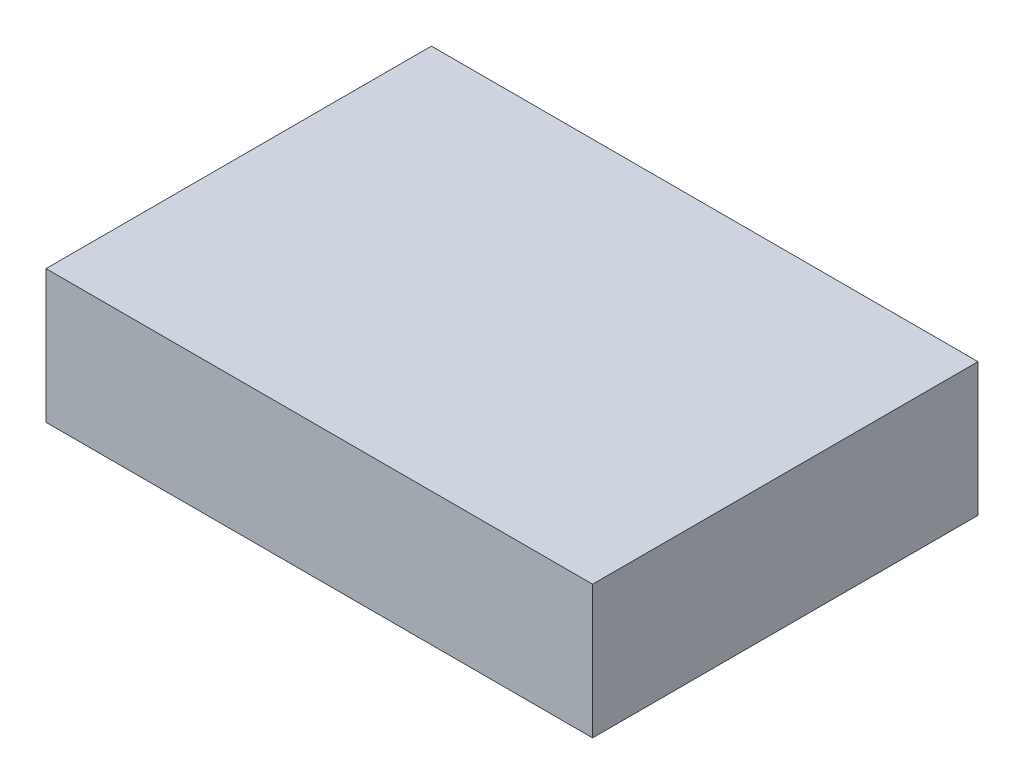
ISO-10303-21;
HEADER;
FILE_DESCRIPTION(('STEP AP214'),'2;1');
FILE_NAME('part.step','',(''),(''),'','','');
FILE_SCHEMA(('AUTOMOTIVE_DESIGN { 1 0 10303 214 1 1 1 1 }'));
ENDSEC;
DATA;
#1=APPLICATION_CONTEXT('core data for automotive mechanical design processes');
#2=APPLICATION_PROTOCOL_DEFINITION('international standard','automotive_design',2000,#1);
#3=PRODUCT_CONTEXT('',#1,'mechanical');
#4=PRODUCT('Part','Part','',(#3));
#5=PRODUCT_RELATED_PRODUCT_CATEGORY('part','',(#4));
#6=PRODUCT_DEFINITION_FORMATION('','',#4);
#7=PRODUCT_DEFINITION_CONTEXT('part definition',#1,'design');
#8=PRODUCT_DEFINITION('design','',#6,#7);
#9=PRODUCT_DEFINITION_SHAPE('','',#8);
#10=(LENGTH_UNIT() NAMED_UNIT(*) SI_UNIT(.MILLI.,.METRE.));
#11=(NAMED_UNIT(*) PLANE_ANGLE_UNIT() SI_UNIT($,.RADIAN.));
#12=(NAMED_UNIT(*) SI_UNIT($,.STERADIAN.) SOLID_ANGLE_UNIT());
#13=UNCERTAINTY_MEASURE_WITH_UNIT(LENGTH_MEASURE(1.E-05),#10,'distance_accuracy_value','');
#14=(GEOMETRIC_REPRESENTATION_CONTEXT(3) GLOBAL_UNCERTAINTY_ASSIGNED_CONTEXT((#13)) GLOBAL_UNIT_ASSIGNED_CONTEXT((#10,
#11,#12)) REPRESENTATION_CONTEXT('',''));
#15=CARTESIAN_POINT('',(0.,0.,0.));
#16=DIRECTION('',(0.,0.,1.));
#17=DIRECTION('',(1.,0.,0.));
#18=AXIS2_PLACEMENT_3D('',#15,#16,#17);
#19=CARTESIAN_POINT('',(0.,19.,0.));
#20=DIRECTION('',(-1.,0.,0.));
#21=DIRECTION('',(0.,0.,1.));
#22=AXIS2_PLACEMENT_3D('',#19,#20,#21);
#23=PLANE('',#22);
#24=DIRECTION('',(0.,0.,-1.));
#25=VECTOR('',#24,1.);
#26=CARTESIAN_POINT('',(0.,0.,0.));
#27=LINE('',#26,#25);
#28=CARTESIAN_POINT('',(0.,0.,55.));
#29=VERTEX_POINT('',#28);
#30=CARTESIAN_POINT('',(0.,0.,0.));
#31=VERTEX_POINT('',#30);
#32=EDGE_CURVE('E97',#29,#31,#27,.T.);
#33=ORIENTED_EDGE('',*,*,#32,.T.);
#34=DIRECTION('',(0.,-1.,0.));
#35=VECTOR('',#34,1.);
#36=CARTESIAN_POINT('',(0.,19.,0.));
#37=LINE('',#36,#35);
#38=CARTESIAN_POINT('',(0.,19.,0.));
#39=VERTEX_POINT('',#38);
#40=EDGE_CURVE('E11',#39,#31,#37,.T.);
#41=ORIENTED_EDGE('',*,*,#40,.F.);
#42=DIRECTION('',(0.,0.,-1.));
#43=VECTOR('',#42,1.);
#44=CARTESIAN_POINT('',(0.,19.,0.));
#45=LINE('',#44,#43);
#46=CARTESIAN_POINT('',(0.,19.,55.));
#47=VERTEX_POINT('',#46);
#48=EDGE_CURVE('E85',#47,#39,#45,.T.);
#49=ORIENTED_EDGE('',*,*,#48,.F.);
#50=DIRECTION('',(0.,-1.,0.));
#51=VECTOR('',#50,1.);
#52=CARTESIAN_POINT('',(0.,19.,55.));
#53=LINE('',#52,#51);
#54=EDGE_CURVE('E93',#47,#29,#53,.T.);
#55=ORIENTED_EDGE('',*,*,#54,.T.);
#56=EDGE_LOOP('',(#33,#41,#49,#55));
#57=FACE_BOUND('',#56,.T.);
#58=ADVANCED_FACE('F34',(#57),#23,.F.);
#59=CARTESIAN_POINT('',(0.,19.,0.));
#60=DIRECTION('',(0.,0.,1.));
#61=DIRECTION('',(1.,0.,0.));
#62=AXIS2_PLACEMENT_3D('',#59,#60,#61);
#63=PLANE('',#62);
#64=DIRECTION('',(-1.,0.,0.));
#65=VECTOR('',#64,1.);
#66=CARTESIAN_POINT('',(0.,0.,0.));
#67=LINE('',#66,#65);
#68=CARTESIAN_POINT('',(-78.,0.,0.));
#69=VERTEX_POINT('',#68);
#70=EDGE_CURVE('E89',#31,#69,#67,.T.);
#71=ORIENTED_EDGE('',*,*,#70,.T.);
#72=DIRECTION('',(0.,-1.,0.));
#73=VECTOR('',#72,1.);
#74=CARTESIAN_POINT('',(-78.,19.,0.));
#75=LINE('',#74,#73);
#76=CARTESIAN_POINT('',(-78.,19.,0.));
#77=VERTEX_POINT('',#76);
#78=EDGE_CURVE('E42',#77,#69,#75,.T.);
#79=ORIENTED_EDGE('',*,*,#78,.F.);
#80=DIRECTION('',(-1.,0.,0.));
#81=VECTOR('',#80,1.);
#82=CARTESIAN_POINT('',(0.,19.,0.));
#83=LINE('',#82,#81);
#84=EDGE_CURVE('E80',#39,#77,#83,.T.);
#85=ORIENTED_EDGE('',*,*,#84,.F.);
#86=ORIENTED_EDGE('',*,*,#40,.T.);
#87=EDGE_LOOP('',(#71,#79,#85,#86));
#88=FACE_BOUND('',#87,.T.);
#89=ADVANCED_FACE('F88',(#88),#63,.F.);
#90=CARTESIAN_POINT('',(-78.,19.,0.));
#91=DIRECTION('',(1.,0.,0.));
#92=DIRECTION('',(0.,0.,-1.));
#93=AXIS2_PLACEMENT_3D('',#90,#91,#92);
#94=PLANE('',#93);
#95=DIRECTION('',(0.,0.,1.));
#96=VECTOR('',#95,1.);
#97=CARTESIAN_POINT('',(-78.,0.,0.));
#98=LINE('',#97,#96);
#99=CARTESIAN_POINT('',(-78.,0.,55.));
#100=VERTEX_POINT('',#99);
#101=EDGE_CURVE('E67',#69,#100,#98,.T.);
#102=ORIENTED_EDGE('',*,*,#101,.T.);
#103=DIRECTION('',(0.,-1.,0.));
#104=VECTOR('',#103,1.);
#105=CARTESIAN_POINT('',(-78.,19.,55.));
#106=LINE('',#105,#104);
#107=CARTESIAN_POINT('',(-78.,19.,55.));
#108=VERTEX_POINT('',#107);
#109=EDGE_CURVE('E90',#108,#100,#106,.T.);
#110=ORIENTED_EDGE('',*,*,#109,.F.);
#111=DIRECTION('',(0.,0.,1.));
#112=VECTOR('',#111,1.);
#113=CARTESIAN_POINT('',(-78.,19.,0.));
#114=LINE('',#113,#112);
#115=EDGE_CURVE('E83',#77,#108,#114,.T.);
#116=ORIENTED_EDGE('',*,*,#115,.F.);
#117=ORIENTED_EDGE('',*,*,#78,.T.);
#118=EDGE_LOOP('',(#102,#110,#116,#117));
#119=FACE_BOUND('',#118,.T.);
#120=ADVANCED_FACE('F91',(#119),#94,.F.);
#121=CARTESIAN_POINT('',(0.,19.,55.));
#122=DIRECTION('',(0.,0.,-1.));
#123=DIRECTION('',(-1.,0.,0.));
#124=AXIS2_PLACEMENT_3D('',#121,#122,#123);
#125=PLANE('',#124);
#126=DIRECTION('',(1.,0.,0.));
#127=VECTOR('',#126,1.);
#128=CARTESIAN_POINT('',(0.,0.,55.));
#129=LINE('',#128,#127);
#130=EDGE_CURVE('E73',#100,#29,#129,.T.);
#131=ORIENTED_EDGE('',*,*,#130,.T.);
#132=ORIENTED_EDGE('',*,*,#54,.F.);
#133=DIRECTION('',(1.,0.,0.));
#134=VECTOR('',#133,1.);
#135=CARTESIAN_POINT('',(0.,19.,55.));
#136=LINE('',#135,#134);
#137=EDGE_CURVE('E50',#108,#47,#136,.T.);
#138=ORIENTED_EDGE('',*,*,#137,.F.);
#139=ORIENTED_EDGE('',*,*,#109,.T.);
#140=EDGE_LOOP('',(#131,#132,#138,#139));
#141=FACE_BOUND('',#140,.T.);
#142=ADVANCED_FACE('F104',(#141),#125,.F.);
#143=CARTESIAN_POINT('',(0.,19.,0.));
#144=DIRECTION('',(0.,-1.,0.));
#145=DIRECTION('',(0.,0.,-1.));
#146=AXIS2_PLACEMENT_3D('',#143,#144,#145);
#147=PLANE('',#146);
#148=ORIENTED_EDGE('',*,*,#48,.T.);
#149=ORIENTED_EDGE('',*,*,#84,.T.);
#150=ORIENTED_EDGE('',*,*,#115,.T.);
#151=ORIENTED_EDGE('',*,*,#137,.T.);
#152=EDGE_LOOP('',(#148,#149,#150,#151));
#153=FACE_BOUND('',#152,.T.);
#154=ADVANCED_FACE('F81',(#153),#147,.F.);
#155=CARTESIAN_POINT('',(0.,0.,0.));
#156=DIRECTION('',(0.,-1.,0.));
#157=DIRECTION('',(0.,0.,-1.));
#158=AXIS2_PLACEMENT_3D('',#155,#156,#157);
#159=PLANE('',#158);
#160=ORIENTED_EDGE('',*,*,#32,.F.);
#161=ORIENTED_EDGE('',*,*,#130,.F.);
#162=ORIENTED_EDGE('',*,*,#101,.F.);
#163=ORIENTED_EDGE('',*,*,#70,.F.);
#164=EDGE_LOOP('',(#160,#161,#162,#163));
#165=FACE_BOUND('',#164,.T.);
#166=ADVANCED_FACE('F107',(#165),#159,.T.);
#167=CLOSED_SHELL('',(#58,#89,#120,#142,#154,#166));
#168=MANIFOLD_SOLID_BREP('B2',#167);
#169=ADVANCED_BREP_SHAPE_REPRESENTATION('',(#18,#168),#14);
#170=SHAPE_DEFINITION_REPRESENTATION(#9,#169);
ENDSEC;
END-ISO-10303-21;
